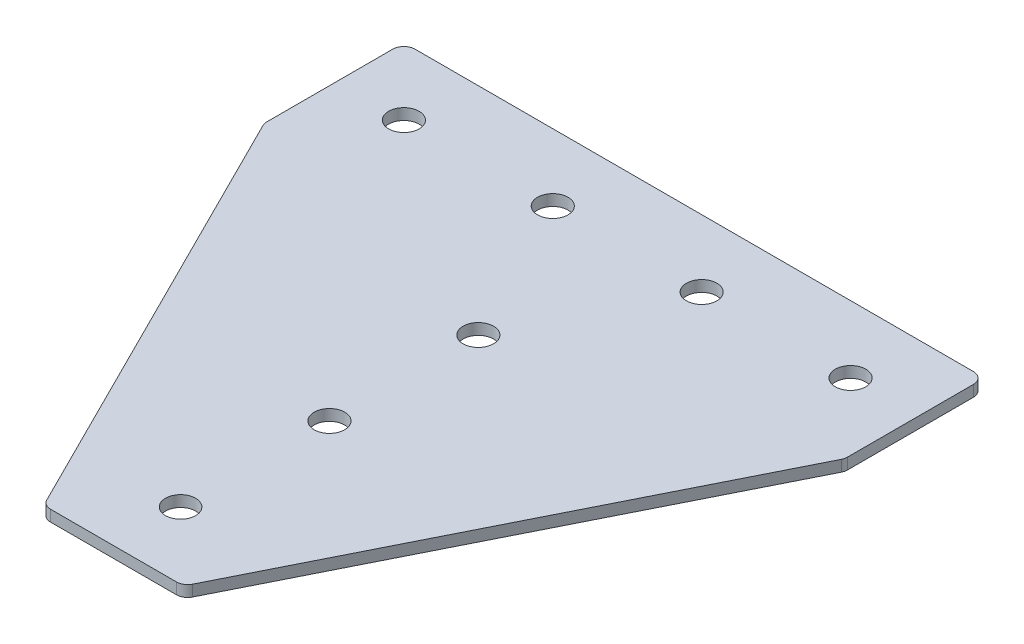
ISO-10303-21;
HEADER;
FILE_DESCRIPTION(('STEP AP214'),'2;1');
FILE_NAME('part.step','',(''),(''),'','','');
FILE_SCHEMA(('AUTOMOTIVE_DESIGN { 1 0 10303 214 1 1 1 1 }'));
ENDSEC;
DATA;
#1=APPLICATION_CONTEXT('core data for automotive mechanical design processes');
#2=APPLICATION_PROTOCOL_DEFINITION('international standard','automotive_design',2000,#1);
#3=PRODUCT_CONTEXT('',#1,'mechanical');
#4=PRODUCT('Part','Part','',(#3));
#5=PRODUCT_RELATED_PRODUCT_CATEGORY('part','',(#4));
#6=PRODUCT_DEFINITION_FORMATION('','',#4);
#7=PRODUCT_DEFINITION_CONTEXT('part definition',#1,'design');
#8=PRODUCT_DEFINITION('design','',#6,#7);
#9=PRODUCT_DEFINITION_SHAPE('','',#8);
#10=(LENGTH_UNIT() NAMED_UNIT(*) SI_UNIT(.MILLI.,.METRE.));
#11=(NAMED_UNIT(*) PLANE_ANGLE_UNIT() SI_UNIT($,.RADIAN.));
#12=(NAMED_UNIT(*) SI_UNIT($,.STERADIAN.) SOLID_ANGLE_UNIT());
#13=UNCERTAINTY_MEASURE_WITH_UNIT(LENGTH_MEASURE(1.E-05),#10,'distance_accuracy_value','');
#14=(GEOMETRIC_REPRESENTATION_CONTEXT(3) GLOBAL_UNCERTAINTY_ASSIGNED_CONTEXT((#13)) GLOBAL_UNIT_ASSIGNED_CONTEXT((#10,
#11,#12)) REPRESENTATION_CONTEXT('',''));
#15=CARTESIAN_POINT('',(0.,0.,0.));
#16=DIRECTION('',(0.,0.,1.));
#17=DIRECTION('',(1.,0.,0.));
#18=AXIS2_PLACEMENT_3D('',#15,#16,#17);
#19=CARTESIAN_POINT('',(-1.64111741986517,1.20798729371791,-61.0664297859648));
#20=DIRECTION('',(0.,-1.,0.));
#21=DIRECTION('',(0.,0.,-1.));
#22=AXIS2_PLACEMENT_3D('',#19,#20,#21);
#23=PLANE('',#22);
#24=CARTESIAN_POINT('',(-1.64111741986518,1.20798729371791,-21.0664297859648));
#25=DIRECTION('',(0.,1.,0.));
#26=DIRECTION('',(0.,0.,1.));
#27=AXIS2_PLACEMENT_3D('',#24,#25,#26);
#28=CIRCLE('',#27,4.1);
#29=CARTESIAN_POINT('',(-1.64111741986518,1.20798729371791,-16.9664297859648));
#30=VERTEX_POINT('',#29);
#31=EDGE_CURVE('E183',#30,#30,#28,.T.);
#32=ORIENTED_EDGE('',*,*,#31,.T.);
#33=EDGE_LOOP('',(#32));
#34=FACE_BOUND('',#33,.T.);
#35=DIRECTION('',(1.,0.,0.));
#36=VECTOR('',#35,1.);
#37=CARTESIAN_POINT('',(-19.6411174198652,1.20798729371791,76.9335702140352));
#38=LINE('',#37,#36);
#39=CARTESIAN_POINT('',(-18.5509474761156,1.20798729371791,76.9335702140352));
#40=VERTEX_POINT('',#39);
#41=CARTESIAN_POINT('',(15.2687126363853,1.20798729371791,76.9335702140352));
#42=VERTEX_POINT('',#41);
#43=EDGE_CURVE('E201',#40,#42,#38,.T.);
#44=ORIENTED_EDGE('',*,*,#43,.F.);
#45=CARTESIAN_POINT('',(-18.5509474761156,1.20798729371791,73.9335702140352));
#46=DIRECTION('',(0.,1.,0.));
#47=DIRECTION('',(0.,0.,-1.));
#48=AXIS2_PLACEMENT_3D('',#45,#46,#47);
#49=CIRCLE('',#48,3.);
#50=CARTESIAN_POINT('',(-21.2342290491154,1.20798729371791,75.275211000535));
#51=VERTEX_POINT('',#50);
#52=EDGE_CURVE('E155',#51,#40,#49,.T.);
#53=ORIENTED_EDGE('',*,*,#52,.F.);
#54=DIRECTION('',(-0.447213595499958,0.,-0.894427190999916));
#55=VECTOR('',#54,1.);
#56=CARTESIAN_POINT('',(-20.4050494423653,1.20798729371791,76.9335702140352));
#57=LINE('',#56,#55);
#58=CARTESIAN_POINT('',(-79.3243989928649,1.20798729371791,-40.9051288869639));
#59=VERTEX_POINT('',#58);
#60=EDGE_CURVE('E142',#51,#59,#57,.T.);
#61=ORIENTED_EDGE('',*,*,#60,.T.);
#62=CARTESIAN_POINT('',(-76.6411174198652,1.20798729371791,-42.2467696734637));
#63=DIRECTION('',(0.,1.,0.));
#64=DIRECTION('',(0.,0.,-1.));
#65=AXIS2_PLACEMENT_3D('',#62,#63,#64);
#66=CIRCLE('',#65,3.);
#67=CARTESIAN_POINT('',(-79.6411174198652,1.20798729371791,-42.2467696734637));
#68=VERTEX_POINT('',#67);
#69=EDGE_CURVE('E153',#68,#59,#66,.T.);
#70=ORIENTED_EDGE('',*,*,#69,.F.);
#71=DIRECTION('',(0.,0.,-1.));
#72=VECTOR('',#71,1.);
#73=CARTESIAN_POINT('',(-79.6411174198652,1.20798729371791,-41.5385657409644));
#74=LINE('',#73,#72);
#75=CARTESIAN_POINT('',(-79.6411174198652,1.20798729371791,-76.0664297859648));
#76=VERTEX_POINT('',#75);
#77=EDGE_CURVE('E124',#68,#76,#74,.T.);
#78=ORIENTED_EDGE('',*,*,#77,.T.);
#79=CARTESIAN_POINT('',(-76.6411174198652,1.20798729371791,-76.0664297859648));
#80=DIRECTION('',(0.,1.,0.));
#81=DIRECTION('',(0.,0.,-1.));
#82=AXIS2_PLACEMENT_3D('',#79,#80,#81);
#83=CIRCLE('',#82,3.);
#84=CARTESIAN_POINT('',(-76.6411174198652,1.20798729371791,-79.0664297859648));
#85=VERTEX_POINT('',#84);
#86=EDGE_CURVE('E150',#85,#76,#83,.T.);
#87=ORIENTED_EDGE('',*,*,#86,.F.);
#88=DIRECTION('',(-1.,0.,0.));
#89=VECTOR('',#88,1.);
#90=CARTESIAN_POINT('',(76.3588825801348,1.20798729371791,-79.0664297859648));
#91=LINE('',#90,#89);
#92=CARTESIAN_POINT('',(73.3588825801348,1.20798729371791,-79.0664297859648));
#93=VERTEX_POINT('',#92);
#94=EDGE_CURVE('E198',#93,#85,#91,.T.);
#95=ORIENTED_EDGE('',*,*,#94,.F.);
#96=CARTESIAN_POINT('',(73.3588825801348,1.20798729371791,-76.0664297859648));
#97=DIRECTION('',(0.,-1.,0.));
#98=DIRECTION('',(0.,0.,-1.));
#99=AXIS2_PLACEMENT_3D('',#96,#97,#98);
#100=CIRCLE('',#99,3.);
#101=CARTESIAN_POINT('',(76.3588825801348,1.20798729371791,-76.0664297859648));
#102=VERTEX_POINT('',#101);
#103=EDGE_CURVE('E222',#93,#102,#100,.T.);
#104=ORIENTED_EDGE('',*,*,#103,.T.);
#105=DIRECTION('',(0.,0.,-1.));
#106=VECTOR('',#105,1.);
#107=CARTESIAN_POINT('',(76.3588825801348,1.20798729371791,-41.5385657409644));
#108=LINE('',#107,#106);
#109=CARTESIAN_POINT('',(76.3588825801348,1.20798729371791,-42.2467696734638));
#110=VERTEX_POINT('',#109);
#111=EDGE_CURVE('E195',#110,#102,#108,.T.);
#112=ORIENTED_EDGE('',*,*,#111,.F.);
#113=CARTESIAN_POINT('',(73.3588825801349,1.20798729371791,-42.2467696734638));
#114=DIRECTION('',(0.,-1.,0.));
#115=DIRECTION('',(0.,0.,-1.));
#116=AXIS2_PLACEMENT_3D('',#113,#114,#115);
#117=CIRCLE('',#116,3.);
#118=CARTESIAN_POINT('',(76.0421641531346,1.20798729371791,-40.9051288869639));
#119=VERTEX_POINT('',#118);
#120=EDGE_CURVE('E31',#110,#119,#117,.T.);
#121=ORIENTED_EDGE('',*,*,#120,.T.);
#122=DIRECTION('',(0.447213595499958,0.,-0.894427190999916));
#123=VECTOR('',#122,1.);
#124=CARTESIAN_POINT('',(17.122814602635,1.20798729371791,76.9335702140352));
#125=LINE('',#124,#123);
#126=CARTESIAN_POINT('',(17.9519942093851,1.20798729371791,75.275211000535));
#127=VERTEX_POINT('',#126);
#128=EDGE_CURVE('E203',#127,#119,#125,.T.);
#129=ORIENTED_EDGE('',*,*,#128,.F.);
#130=CARTESIAN_POINT('',(15.2687126363853,1.20798729371791,73.9335702140352));
#131=DIRECTION('',(0.,-1.,0.));
#132=DIRECTION('',(0.,0.,-1.));
#133=AXIS2_PLACEMENT_3D('',#130,#131,#132);
#134=CIRCLE('',#133,3.);
#135=EDGE_CURVE('E225',#127,#42,#134,.T.);
#136=ORIENTED_EDGE('',*,*,#135,.T.);
#137=EDGE_LOOP('',(#44,#53,#61,#70,#78,#87,#95,#104,#112,#121,#129,#136));
#138=FACE_BOUND('',#137,.T.);
#139=CARTESIAN_POINT('',(-1.64111741986518,1.20798729371791,58.9335702140352));
#140=DIRECTION('',(0.,1.,0.));
#141=DIRECTION('',(0.,0.,1.));
#142=AXIS2_PLACEMENT_3D('',#139,#140,#141);
#143=CIRCLE('',#142,4.05);
#144=CARTESIAN_POINT('',(-1.64111741986518,1.20798729371791,62.9835702140352));
#145=VERTEX_POINT('',#144);
#146=EDGE_CURVE('E171',#145,#145,#143,.T.);
#147=ORIENTED_EDGE('',*,*,#146,.T.);
#148=EDGE_LOOP('',(#147));
#149=FACE_BOUND('',#148,.T.);
#150=CARTESIAN_POINT('',(-1.64111741986518,1.20798729371791,18.9335702140352));
#151=DIRECTION('',(0.,1.,0.));
#152=DIRECTION('',(0.,0.,1.));
#153=AXIS2_PLACEMENT_3D('',#150,#151,#152);
#154=CIRCLE('',#153,4.1);
#155=CARTESIAN_POINT('',(-1.64111741986518,1.20798729371791,23.0335702140352));
#156=VERTEX_POINT('',#155);
#157=EDGE_CURVE('E177',#156,#156,#154,.T.);
#158=ORIENTED_EDGE('',*,*,#157,.T.);
#159=EDGE_LOOP('',(#158));
#160=FACE_BOUND('',#159,.T.);
#161=CARTESIAN_POINT('',(58.3588825801348,1.20798729371791,-61.0664297859648));
#162=DIRECTION('',(0.,1.,0.));
#163=DIRECTION('',(0.,0.,1.));
#164=AXIS2_PLACEMENT_3D('',#161,#162,#163);
#165=CIRCLE('',#164,4.09999999999999);
#166=CARTESIAN_POINT('',(58.3588825801348,1.20798729371791,-56.9664297859648));
#167=VERTEX_POINT('',#166);
#168=EDGE_CURVE('E165',#167,#167,#165,.T.);
#169=ORIENTED_EDGE('',*,*,#168,.T.);
#170=EDGE_LOOP('',(#169));
#171=FACE_BOUND('',#170,.T.);
#172=CARTESIAN_POINT('',(18.3588825801348,1.20798729371791,-61.0664297859648));
#173=DIRECTION('',(0.,1.,0.));
#174=DIRECTION('',(0.,0.,1.));
#175=AXIS2_PLACEMENT_3D('',#172,#173,#174);
#176=CIRCLE('',#175,4.1);
#177=CARTESIAN_POINT('',(18.3588825801348,1.20798729371791,-56.9664297859648));
#178=VERTEX_POINT('',#177);
#179=EDGE_CURVE('E189',#178,#178,#176,.T.);
#180=ORIENTED_EDGE('',*,*,#179,.T.);
#181=EDGE_LOOP('',(#180));
#182=FACE_BOUND('',#181,.T.);
#183=CARTESIAN_POINT('',(-61.6411174198652,1.20798729371791,-61.0664297859648));
#184=DIRECTION('',(0.,-1.,0.));
#185=DIRECTION('',(0.,0.,1.));
#186=AXIS2_PLACEMENT_3D('',#183,#184,#185);
#187=CIRCLE('',#186,4.09999999999999);
#188=CARTESIAN_POINT('',(-61.6411174198652,1.20798729371791,-56.9664297859648));
#189=VERTEX_POINT('',#188);
#190=EDGE_CURVE('E265',#189,#189,#187,.T.);
#191=ORIENTED_EDGE('',*,*,#190,.F.);
#192=EDGE_LOOP('',(#191));
#193=FACE_BOUND('',#192,.T.);
#194=CARTESIAN_POINT('',(-21.6411174198652,1.20798729371791,-61.0664297859648));
#195=DIRECTION('',(0.,-1.,0.));
#196=DIRECTION('',(0.,0.,1.));
#197=AXIS2_PLACEMENT_3D('',#194,#195,#196);
#198=CIRCLE('',#197,4.1);
#199=CARTESIAN_POINT('',(-21.6411174198652,1.20798729371791,-56.9664297859648));
#200=VERTEX_POINT('',#199);
#201=EDGE_CURVE('E135',#200,#200,#198,.T.);
#202=ORIENTED_EDGE('',*,*,#201,.F.);
#203=EDGE_LOOP('',(#202));
#204=FACE_BOUND('',#203,.T.);
#205=ADVANCED_FACE('F16',(#34,#138,#149,#160,#171,#182,#193,#204),#23,.T.);
#206=CARTESIAN_POINT('',(76.3588825801348,1.20798729371791,-41.5385657409644));
#207=DIRECTION('',(1.,0.,0.));
#208=DIRECTION('',(0.,0.,-1.));
#209=AXIS2_PLACEMENT_3D('',#206,#207,#208);
#210=PLANE('',#209);
#211=DIRECTION('',(0.,0.,-1.));
#212=VECTOR('',#211,1.);
#213=CARTESIAN_POINT('',(76.3588825801348,4.20798729371791,-41.5385657409644));
#214=LINE('',#213,#212);
#215=CARTESIAN_POINT('',(76.3588825801348,4.20798729371791,-42.2467696734638));
#216=VERTEX_POINT('',#215);
#217=CARTESIAN_POINT('',(76.3588825801348,4.20798729371791,-76.0664297859648));
#218=VERTEX_POINT('',#217);
#219=EDGE_CURVE('E192',#216,#218,#214,.T.);
#220=ORIENTED_EDGE('',*,*,#219,.F.);
#221=DIRECTION('',(0.,1.,0.));
#222=VECTOR('',#221,1.);
#223=CARTESIAN_POINT('',(76.3588825801348,1.20798729371791,-42.2467696734638));
#224=LINE('',#223,#222);
#225=EDGE_CURVE('E24',#216,#110,#224,.F.);
#226=ORIENTED_EDGE('',*,*,#225,.T.);
#227=ORIENTED_EDGE('',*,*,#111,.T.);
#228=DIRECTION('',(0.,1.,0.));
#229=VECTOR('',#228,1.);
#230=CARTESIAN_POINT('',(76.3588825801348,1.20798729371791,-76.0664297859648));
#231=LINE('',#230,#229);
#232=EDGE_CURVE('E232',#102,#218,#231,.T.);
#233=ORIENTED_EDGE('',*,*,#232,.T.);
#234=EDGE_LOOP('',(#220,#226,#227,#233));
#235=FACE_BOUND('',#234,.T.);
#236=ADVANCED_FACE('F237',(#235),#210,.T.);
#237=CARTESIAN_POINT('',(17.122814602635,1.20798729371791,76.9335702140352));
#238=DIRECTION('',(0.894427190999916,0.,0.447213595499958));
#239=DIRECTION('',(0.447213595499958,0.,-0.894427190999916));
#240=AXIS2_PLACEMENT_3D('',#237,#238,#239);
#241=PLANE('',#240);
#242=DIRECTION('',(0.447213595499958,0.,-0.894427190999916));
#243=VECTOR('',#242,1.);
#244=CARTESIAN_POINT('',(17.122814602635,4.20798729371791,76.9335702140352));
#245=LINE('',#244,#243);
#246=CARTESIAN_POINT('',(17.9519942093851,4.20798729371791,75.275211000535));
#247=VERTEX_POINT('',#246);
#248=CARTESIAN_POINT('',(76.0421641531346,4.20798729371791,-40.9051288869639));
#249=VERTEX_POINT('',#248);
#250=EDGE_CURVE('E199',#247,#249,#245,.T.);
#251=ORIENTED_EDGE('',*,*,#250,.F.);
#252=DIRECTION('',(0.,1.,0.));
#253=VECTOR('',#252,1.);
#254=CARTESIAN_POINT('',(17.9519942093851,1.20798729371791,75.275211000535));
#255=LINE('',#254,#253);
#256=EDGE_CURVE('E38',#247,#127,#255,.F.);
#257=ORIENTED_EDGE('',*,*,#256,.T.);
#258=ORIENTED_EDGE('',*,*,#128,.T.);
#259=DIRECTION('',(0.,1.,0.));
#260=VECTOR('',#259,1.);
#261=CARTESIAN_POINT('',(76.0421641531346,1.20798729371791,-40.9051288869639));
#262=LINE('',#261,#260);
#263=EDGE_CURVE('E228',#119,#249,#262,.T.);
#264=ORIENTED_EDGE('',*,*,#263,.T.);
#265=EDGE_LOOP('',(#251,#257,#258,#264));
#266=FACE_BOUND('',#265,.T.);
#267=ADVANCED_FACE('F245',(#266),#241,.T.);
#268=CARTESIAN_POINT('',(-19.6411174198652,1.20798729371791,76.9335702140352));
#269=DIRECTION('',(0.,0.,1.));
#270=DIRECTION('',(1.,0.,0.));
#271=AXIS2_PLACEMENT_3D('',#268,#269,#270);
#272=PLANE('',#271);
#273=DIRECTION('',(1.,0.,0.));
#274=VECTOR('',#273,1.);
#275=CARTESIAN_POINT('',(-19.6411174198652,4.20798729371791,76.9335702140352));
#276=LINE('',#275,#274);
#277=CARTESIAN_POINT('',(-18.5509474761156,4.20798729371791,76.9335702140352));
#278=VERTEX_POINT('',#277);
#279=CARTESIAN_POINT('',(15.2687126363853,4.20798729371791,76.9335702140352));
#280=VERTEX_POINT('',#279);
#281=EDGE_CURVE('E210',#278,#280,#276,.T.);
#282=ORIENTED_EDGE('',*,*,#281,.F.);
#283=DIRECTION('',(0.,1.,0.));
#284=VECTOR('',#283,1.);
#285=CARTESIAN_POINT('',(-18.5509474761156,1.20798729371791,76.9335702140352));
#286=LINE('',#285,#284);
#287=EDGE_CURVE('E147',#40,#278,#286,.T.);
#288=ORIENTED_EDGE('',*,*,#287,.F.);
#289=ORIENTED_EDGE('',*,*,#43,.T.);
#290=DIRECTION('',(0.,1.,0.));
#291=VECTOR('',#290,1.);
#292=CARTESIAN_POINT('',(15.2687126363853,1.20798729371791,76.9335702140352));
#293=LINE('',#292,#291);
#294=EDGE_CURVE('E219',#42,#280,#293,.T.);
#295=ORIENTED_EDGE('',*,*,#294,.T.);
#296=EDGE_LOOP('',(#282,#288,#289,#295));
#297=FACE_BOUND('',#296,.T.);
#298=ADVANCED_FACE('F252',(#297),#272,.T.);
#299=CARTESIAN_POINT('',(76.3588825801348,1.20798729371791,-79.0664297859648));
#300=DIRECTION('',(0.,0.,-1.));
#301=DIRECTION('',(-1.,0.,0.));
#302=AXIS2_PLACEMENT_3D('',#299,#300,#301);
#303=PLANE('',#302);
#304=ORIENTED_EDGE('',*,*,#94,.T.);
#305=DIRECTION('',(0.,1.,0.));
#306=VECTOR('',#305,1.);
#307=CARTESIAN_POINT('',(-76.6411174198652,1.20798729371791,-79.0664297859648));
#308=LINE('',#307,#306);
#309=CARTESIAN_POINT('',(-76.6411174198652,4.20798729371791,-79.0664297859648));
#310=VERTEX_POINT('',#309);
#311=EDGE_CURVE('E126',#310,#85,#308,.F.);
#312=ORIENTED_EDGE('',*,*,#311,.F.);
#313=DIRECTION('',(-1.,0.,0.));
#314=VECTOR('',#313,1.);
#315=CARTESIAN_POINT('',(76.3588825801348,4.20798729371791,-79.0664297859648));
#316=LINE('',#315,#314);
#317=CARTESIAN_POINT('',(73.3588825801348,4.20798729371791,-79.0664297859648));
#318=VERTEX_POINT('',#317);
#319=EDGE_CURVE('E208',#318,#310,#316,.T.);
#320=ORIENTED_EDGE('',*,*,#319,.F.);
#321=DIRECTION('',(0.,1.,0.));
#322=VECTOR('',#321,1.);
#323=CARTESIAN_POINT('',(73.3588825801348,1.20798729371791,-79.0664297859648));
#324=LINE('',#323,#322);
#325=EDGE_CURVE('E10',#318,#93,#324,.F.);
#326=ORIENTED_EDGE('',*,*,#325,.T.);
#327=EDGE_LOOP('',(#304,#312,#320,#326));
#328=FACE_BOUND('',#327,.T.);
#329=ADVANCED_FACE('F290',(#328),#303,.T.);
#330=CARTESIAN_POINT('',(-1.64111741986517,4.20798729371791,-61.0664297859648));
#331=DIRECTION('',(0.,-1.,0.));
#332=DIRECTION('',(0.,0.,-1.));
#333=AXIS2_PLACEMENT_3D('',#330,#331,#332);
#334=PLANE('',#333);
#335=CARTESIAN_POINT('',(-1.64111741986518,4.20798729371791,-21.0664297859648));
#336=DIRECTION('',(0.,1.,0.));
#337=DIRECTION('',(0.,0.,1.));
#338=AXIS2_PLACEMENT_3D('',#335,#336,#337);
#339=CIRCLE('',#338,4.1);
#340=CARTESIAN_POINT('',(-1.64111741986518,4.20798729371791,-16.9664297859648));
#341=VERTEX_POINT('',#340);
#342=EDGE_CURVE('E180',#341,#341,#339,.T.);
#343=ORIENTED_EDGE('',*,*,#342,.F.);
#344=EDGE_LOOP('',(#343));
#345=FACE_BOUND('',#344,.T.);
#346=CARTESIAN_POINT('',(-18.5509474761156,4.20798729371791,73.9335702140352));
#347=DIRECTION('',(0.,1.,0.));
#348=DIRECTION('',(0.,0.,-1.));
#349=AXIS2_PLACEMENT_3D('',#346,#347,#348);
#350=CIRCLE('',#349,3.);
#351=CARTESIAN_POINT('',(-21.2342290491154,4.20798729371791,75.275211000535));
#352=VERTEX_POINT('',#351);
#353=EDGE_CURVE('E116',#278,#352,#350,.F.);
#354=ORIENTED_EDGE('',*,*,#353,.F.);
#355=ORIENTED_EDGE('',*,*,#281,.T.);
#356=CARTESIAN_POINT('',(15.2687126363853,4.20798729371791,73.9335702140352));
#357=DIRECTION('',(0.,-1.,0.));
#358=DIRECTION('',(0.,0.,-1.));
#359=AXIS2_PLACEMENT_3D('',#356,#357,#358);
#360=CIRCLE('',#359,3.);
#361=EDGE_CURVE('E217',#280,#247,#360,.F.);
#362=ORIENTED_EDGE('',*,*,#361,.T.);
#363=ORIENTED_EDGE('',*,*,#250,.T.);
#364=CARTESIAN_POINT('',(73.3588825801349,4.20798729371791,-42.2467696734638));
#365=DIRECTION('',(0.,-1.,0.));
#366=DIRECTION('',(0.,0.,-1.));
#367=AXIS2_PLACEMENT_3D('',#364,#365,#366);
#368=CIRCLE('',#367,3.);
#369=EDGE_CURVE('E215',#249,#216,#368,.F.);
#370=ORIENTED_EDGE('',*,*,#369,.T.);
#371=ORIENTED_EDGE('',*,*,#219,.T.);
#372=CARTESIAN_POINT('',(73.3588825801348,4.20798729371791,-76.0664297859648));
#373=DIRECTION('',(0.,-1.,0.));
#374=DIRECTION('',(0.,0.,-1.));
#375=AXIS2_PLACEMENT_3D('',#372,#373,#374);
#376=CIRCLE('',#375,3.);
#377=EDGE_CURVE('E205',#218,#318,#376,.F.);
#378=ORIENTED_EDGE('',*,*,#377,.T.);
#379=ORIENTED_EDGE('',*,*,#319,.T.);
#380=CARTESIAN_POINT('',(-76.6411174198652,4.20798729371791,-76.0664297859648));
#381=DIRECTION('',(0.,1.,0.));
#382=DIRECTION('',(0.,0.,-1.));
#383=AXIS2_PLACEMENT_3D('',#380,#381,#382);
#384=CIRCLE('',#383,3.);
#385=CARTESIAN_POINT('',(-79.6411174198652,4.20798729371791,-76.0664297859648));
#386=VERTEX_POINT('',#385);
#387=EDGE_CURVE('E117',#386,#310,#384,.F.);
#388=ORIENTED_EDGE('',*,*,#387,.F.);
#389=DIRECTION('',(0.,0.,-1.));
#390=VECTOR('',#389,1.);
#391=CARTESIAN_POINT('',(-79.6411174198652,4.20798729371791,-41.5385657409644));
#392=LINE('',#391,#390);
#393=CARTESIAN_POINT('',(-79.6411174198652,4.20798729371791,-42.2467696734637));
#394=VERTEX_POINT('',#393);
#395=EDGE_CURVE('E122',#394,#386,#392,.T.);
#396=ORIENTED_EDGE('',*,*,#395,.F.);
#397=CARTESIAN_POINT('',(-76.6411174198652,4.20798729371791,-42.2467696734637));
#398=DIRECTION('',(0.,1.,0.));
#399=DIRECTION('',(0.,0.,-1.));
#400=AXIS2_PLACEMENT_3D('',#397,#398,#399);
#401=CIRCLE('',#400,3.);
#402=CARTESIAN_POINT('',(-79.3243989928649,4.20798729371791,-40.9051288869639));
#403=VERTEX_POINT('',#402);
#404=EDGE_CURVE('E105',#403,#394,#401,.F.);
#405=ORIENTED_EDGE('',*,*,#404,.F.);
#406=DIRECTION('',(-0.447213595499958,0.,-0.894427190999916));
#407=VECTOR('',#406,1.);
#408=CARTESIAN_POINT('',(-20.4050494423653,4.20798729371791,76.9335702140352));
#409=LINE('',#408,#407);
#410=EDGE_CURVE('E134',#352,#403,#409,.T.);
#411=ORIENTED_EDGE('',*,*,#410,.F.);
#412=EDGE_LOOP('',(#354,#355,#362,#363,#370,#371,#378,#379,#388,#396,#405,#411));
#413=FACE_BOUND('',#412,.T.);
#414=CARTESIAN_POINT('',(-1.64111741986518,4.20798729371791,58.9335702140352));
#415=DIRECTION('',(0.,1.,0.));
#416=DIRECTION('',(0.,0.,1.));
#417=AXIS2_PLACEMENT_3D('',#414,#415,#416);
#418=CIRCLE('',#417,4.05);
#419=CARTESIAN_POINT('',(-1.64111741986518,4.20798729371791,62.9835702140352));
#420=VERTEX_POINT('',#419);
#421=EDGE_CURVE('E168',#420,#420,#418,.T.);
#422=ORIENTED_EDGE('',*,*,#421,.F.);
#423=EDGE_LOOP('',(#422));
#424=FACE_BOUND('',#423,.T.);
#425=CARTESIAN_POINT('',(58.3588825801348,4.20798729371791,-61.0664297859648));
#426=DIRECTION('',(0.,1.,0.));
#427=DIRECTION('',(0.,0.,1.));
#428=AXIS2_PLACEMENT_3D('',#425,#426,#427);
#429=CIRCLE('',#428,4.09999999999999);
#430=CARTESIAN_POINT('',(58.3588825801348,4.20798729371791,-56.9664297859648));
#431=VERTEX_POINT('',#430);
#432=EDGE_CURVE('E164',#431,#431,#429,.T.);
#433=ORIENTED_EDGE('',*,*,#432,.F.);
#434=EDGE_LOOP('',(#433));
#435=FACE_BOUND('',#434,.T.);
#436=CARTESIAN_POINT('',(-1.64111741986518,4.20798729371791,18.9335702140352));
#437=DIRECTION('',(0.,1.,0.));
#438=DIRECTION('',(0.,0.,1.));
#439=AXIS2_PLACEMENT_3D('',#436,#437,#438);
#440=CIRCLE('',#439,4.1);
#441=CARTESIAN_POINT('',(-1.64111741986518,4.20798729371791,23.0335702140352));
#442=VERTEX_POINT('',#441);
#443=EDGE_CURVE('E174',#442,#442,#440,.T.);
#444=ORIENTED_EDGE('',*,*,#443,.F.);
#445=EDGE_LOOP('',(#444));
#446=FACE_BOUND('',#445,.T.);
#447=CARTESIAN_POINT('',(18.3588825801348,4.20798729371791,-61.0664297859648));
#448=DIRECTION('',(0.,1.,0.));
#449=DIRECTION('',(0.,0.,1.));
#450=AXIS2_PLACEMENT_3D('',#447,#448,#449);
#451=CIRCLE('',#450,4.1);
#452=CARTESIAN_POINT('',(18.3588825801348,4.20798729371791,-56.9664297859648));
#453=VERTEX_POINT('',#452);
#454=EDGE_CURVE('E186',#453,#453,#451,.T.);
#455=ORIENTED_EDGE('',*,*,#454,.F.);
#456=EDGE_LOOP('',(#455));
#457=FACE_BOUND('',#456,.T.);
#458=CARTESIAN_POINT('',(-61.6411174198652,4.20798729371791,-61.0664297859648));
#459=DIRECTION('',(0.,-1.,0.));
#460=DIRECTION('',(0.,0.,1.));
#461=AXIS2_PLACEMENT_3D('',#458,#459,#460);
#462=CIRCLE('',#461,4.09999999999999);
#463=CARTESIAN_POINT('',(-61.6411174198652,4.20798729371791,-56.9664297859648));
#464=VERTEX_POINT('',#463);
#465=EDGE_CURVE('E267',#464,#464,#462,.T.);
#466=ORIENTED_EDGE('',*,*,#465,.T.);
#467=EDGE_LOOP('',(#466));
#468=FACE_BOUND('',#467,.T.);
#469=CARTESIAN_POINT('',(-21.6411174198652,4.20798729371791,-61.0664297859648));
#470=DIRECTION('',(0.,-1.,0.));
#471=DIRECTION('',(0.,0.,1.));
#472=AXIS2_PLACEMENT_3D('',#469,#470,#471);
#473=CIRCLE('',#472,4.1);
#474=CARTESIAN_POINT('',(-21.6411174198652,4.20798729371791,-56.9664297859648));
#475=VERTEX_POINT('',#474);
#476=EDGE_CURVE('E139',#475,#475,#473,.T.);
#477=ORIENTED_EDGE('',*,*,#476,.T.);
#478=EDGE_LOOP('',(#477));
#479=FACE_BOUND('',#478,.T.);
#480=ADVANCED_FACE('F130',(#345,#413,#424,#435,#446,#457,#468,#479),#334,.F.);
#481=CARTESIAN_POINT('',(15.2687126363853,1.20798729371791,73.9335702140352));
#482=DIRECTION('',(0.,1.,0.));
#483=DIRECTION('',(0.,0.,1.));
#484=AXIS2_PLACEMENT_3D('',#481,#482,#483);
#485=CYLINDRICAL_SURFACE('',#484,3.);
#486=ORIENTED_EDGE('',*,*,#135,.F.);
#487=ORIENTED_EDGE('',*,*,#256,.F.);
#488=ORIENTED_EDGE('',*,*,#361,.F.);
#489=ORIENTED_EDGE('',*,*,#294,.F.);
#490=EDGE_LOOP('',(#486,#487,#488,#489));
#491=FACE_BOUND('',#490,.T.);
#492=ADVANCED_FACE('F250',(#491),#485,.T.);
#493=CARTESIAN_POINT('',(73.3588825801349,1.20798729371791,-42.2467696734638));
#494=DIRECTION('',(0.,1.,0.));
#495=DIRECTION('',(0.,0.,1.));
#496=AXIS2_PLACEMENT_3D('',#493,#494,#495);
#497=CYLINDRICAL_SURFACE('',#496,3.);
#498=ORIENTED_EDGE('',*,*,#120,.F.);
#499=ORIENTED_EDGE('',*,*,#225,.F.);
#500=ORIENTED_EDGE('',*,*,#369,.F.);
#501=ORIENTED_EDGE('',*,*,#263,.F.);
#502=EDGE_LOOP('',(#498,#499,#500,#501));
#503=FACE_BOUND('',#502,.T.);
#504=ADVANCED_FACE('F244',(#503),#497,.T.);
#505=CARTESIAN_POINT('',(73.3588825801348,1.20798729371791,-76.0664297859648));
#506=DIRECTION('',(0.,1.,0.));
#507=DIRECTION('',(0.,0.,1.));
#508=AXIS2_PLACEMENT_3D('',#505,#506,#507);
#509=CYLINDRICAL_SURFACE('',#508,3.);
#510=ORIENTED_EDGE('',*,*,#103,.F.);
#511=ORIENTED_EDGE('',*,*,#325,.F.);
#512=ORIENTED_EDGE('',*,*,#377,.F.);
#513=ORIENTED_EDGE('',*,*,#232,.F.);
#514=EDGE_LOOP('',(#510,#511,#512,#513));
#515=FACE_BOUND('',#514,.T.);
#516=ADVANCED_FACE('F18',(#515),#509,.T.);
#517=CARTESIAN_POINT('',(18.3588825801348,1.20798729371791,-61.0664297859648));
#518=DIRECTION('',(0.,1.,0.));
#519=DIRECTION('',(0.,0.,1.));
#520=AXIS2_PLACEMENT_3D('',#517,#518,#519);
#521=CYLINDRICAL_SURFACE('',#520,4.1);
#522=ORIENTED_EDGE('',*,*,#179,.F.);
#523=EDGE_LOOP('',(#522));
#524=FACE_BOUND('',#523,.T.);
#525=ORIENTED_EDGE('',*,*,#454,.T.);
#526=EDGE_LOOP('',(#525));
#527=FACE_BOUND('',#526,.T.);
#528=ADVANCED_FACE('F307',(#524,#527),#521,.F.);
#529=CARTESIAN_POINT('',(-1.64111741986518,1.20798729371791,-21.0664297859648));
#530=DIRECTION('',(0.,1.,0.));
#531=DIRECTION('',(0.,0.,1.));
#532=AXIS2_PLACEMENT_3D('',#529,#530,#531);
#533=CYLINDRICAL_SURFACE('',#532,4.1);
#534=ORIENTED_EDGE('',*,*,#31,.F.);
#535=EDGE_LOOP('',(#534));
#536=FACE_BOUND('',#535,.T.);
#537=ORIENTED_EDGE('',*,*,#342,.T.);
#538=EDGE_LOOP('',(#537));
#539=FACE_BOUND('',#538,.T.);
#540=ADVANCED_FACE('F312',(#536,#539),#533,.F.);
#541=CARTESIAN_POINT('',(-1.64111741986518,1.20798729371791,18.9335702140352));
#542=DIRECTION('',(0.,1.,0.));
#543=DIRECTION('',(0.,0.,1.));
#544=AXIS2_PLACEMENT_3D('',#541,#542,#543);
#545=CYLINDRICAL_SURFACE('',#544,4.1);
#546=ORIENTED_EDGE('',*,*,#443,.T.);
#547=EDGE_LOOP('',(#546));
#548=FACE_BOUND('',#547,.T.);
#549=ORIENTED_EDGE('',*,*,#157,.F.);
#550=EDGE_LOOP('',(#549));
#551=FACE_BOUND('',#550,.T.);
#552=ADVANCED_FACE('F334',(#548,#551),#545,.F.);
#553=CARTESIAN_POINT('',(-1.64111741986518,1.20798729371791,58.9335702140352));
#554=DIRECTION('',(0.,1.,0.));
#555=DIRECTION('',(0.,0.,1.));
#556=AXIS2_PLACEMENT_3D('',#553,#554,#555);
#557=CYLINDRICAL_SURFACE('',#556,4.05);
#558=ORIENTED_EDGE('',*,*,#421,.T.);
#559=EDGE_LOOP('',(#558));
#560=FACE_BOUND('',#559,.T.);
#561=ORIENTED_EDGE('',*,*,#146,.F.);
#562=EDGE_LOOP('',(#561));
#563=FACE_BOUND('',#562,.T.);
#564=ADVANCED_FACE('F330',(#560,#563),#557,.F.);
#565=CARTESIAN_POINT('',(58.3588825801348,1.20798729371791,-61.0664297859648));
#566=DIRECTION('',(0.,1.,0.));
#567=DIRECTION('',(0.,0.,1.));
#568=AXIS2_PLACEMENT_3D('',#565,#566,#567);
#569=CYLINDRICAL_SURFACE('',#568,4.09999999999999);
#570=ORIENTED_EDGE('',*,*,#168,.F.);
#571=EDGE_LOOP('',(#570));
#572=FACE_BOUND('',#571,.T.);
#573=ORIENTED_EDGE('',*,*,#432,.T.);
#574=EDGE_LOOP('',(#573));
#575=FACE_BOUND('',#574,.T.);
#576=ADVANCED_FACE('F327',(#572,#575),#569,.F.);
#577=CARTESIAN_POINT('',(-79.6411174198652,1.20798729371791,-41.5385657409644));
#578=DIRECTION('',(-1.,0.,0.));
#579=DIRECTION('',(0.,0.,-1.));
#580=AXIS2_PLACEMENT_3D('',#577,#578,#579);
#581=PLANE('',#580);
#582=ORIENTED_EDGE('',*,*,#395,.T.);
#583=DIRECTION('',(0.,1.,0.));
#584=VECTOR('',#583,1.);
#585=CARTESIAN_POINT('',(-79.6411174198652,1.20798729371791,-76.0664297859648));
#586=LINE('',#585,#584);
#587=EDGE_CURVE('E127',#76,#386,#586,.T.);
#588=ORIENTED_EDGE('',*,*,#587,.F.);
#589=ORIENTED_EDGE('',*,*,#77,.F.);
#590=DIRECTION('',(0.,1.,0.));
#591=VECTOR('',#590,1.);
#592=CARTESIAN_POINT('',(-79.6411174198652,1.20798729371791,-42.2467696734637));
#593=LINE('',#592,#591);
#594=EDGE_CURVE('E109',#394,#68,#593,.F.);
#595=ORIENTED_EDGE('',*,*,#594,.F.);
#596=EDGE_LOOP('',(#582,#588,#589,#595));
#597=FACE_BOUND('',#596,.T.);
#598=ADVANCED_FACE('F121',(#597),#581,.T.);
#599=CARTESIAN_POINT('',(-20.4050494423653,1.20798729371791,76.9335702140352));
#600=DIRECTION('',(-0.894427190999916,0.,0.447213595499958));
#601=DIRECTION('',(-0.447213595499959,0.,-0.894427190999916));
#602=AXIS2_PLACEMENT_3D('',#599,#600,#601);
#603=PLANE('',#602);
#604=ORIENTED_EDGE('',*,*,#410,.T.);
#605=DIRECTION('',(0.,1.,0.));
#606=VECTOR('',#605,1.);
#607=CARTESIAN_POINT('',(-79.3243989928649,1.20798729371791,-40.9051288869639));
#608=LINE('',#607,#606);
#609=EDGE_CURVE('E111',#59,#403,#608,.T.);
#610=ORIENTED_EDGE('',*,*,#609,.F.);
#611=ORIENTED_EDGE('',*,*,#60,.F.);
#612=DIRECTION('',(0.,1.,0.));
#613=VECTOR('',#612,1.);
#614=CARTESIAN_POINT('',(-21.2342290491154,1.20798729371791,75.275211000535));
#615=LINE('',#614,#613);
#616=EDGE_CURVE('E159',#352,#51,#615,.F.);
#617=ORIENTED_EDGE('',*,*,#616,.F.);
#618=EDGE_LOOP('',(#604,#610,#611,#617));
#619=FACE_BOUND('',#618,.T.);
#620=ADVANCED_FACE('F261',(#619),#603,.T.);
#621=CARTESIAN_POINT('',(-18.5509474761156,1.20798729371791,73.9335702140352));
#622=DIRECTION('',(0.,1.,0.));
#623=DIRECTION('',(0.,0.,1.));
#624=AXIS2_PLACEMENT_3D('',#621,#622,#623);
#625=CYLINDRICAL_SURFACE('',#624,3.);
#626=ORIENTED_EDGE('',*,*,#52,.T.);
#627=ORIENTED_EDGE('',*,*,#287,.T.);
#628=ORIENTED_EDGE('',*,*,#353,.T.);
#629=ORIENTED_EDGE('',*,*,#616,.T.);
#630=EDGE_LOOP('',(#626,#627,#628,#629));
#631=FACE_BOUND('',#630,.T.);
#632=ADVANCED_FACE('F258',(#631),#625,.T.);
#633=CARTESIAN_POINT('',(-76.6411174198652,1.20798729371791,-42.2467696734637));
#634=DIRECTION('',(0.,1.,0.));
#635=DIRECTION('',(0.,0.,1.));
#636=AXIS2_PLACEMENT_3D('',#633,#634,#635);
#637=CYLINDRICAL_SURFACE('',#636,3.);
#638=ORIENTED_EDGE('',*,*,#69,.T.);
#639=ORIENTED_EDGE('',*,*,#609,.T.);
#640=ORIENTED_EDGE('',*,*,#404,.T.);
#641=ORIENTED_EDGE('',*,*,#594,.T.);
#642=EDGE_LOOP('',(#638,#639,#640,#641));
#643=FACE_BOUND('',#642,.T.);
#644=ADVANCED_FACE('F108',(#643),#637,.T.);
#645=CARTESIAN_POINT('',(-76.6411174198652,1.20798729371791,-76.0664297859648));
#646=DIRECTION('',(0.,1.,0.));
#647=DIRECTION('',(0.,0.,1.));
#648=AXIS2_PLACEMENT_3D('',#645,#646,#647);
#649=CYLINDRICAL_SURFACE('',#648,3.);
#650=ORIENTED_EDGE('',*,*,#86,.T.);
#651=ORIENTED_EDGE('',*,*,#587,.T.);
#652=ORIENTED_EDGE('',*,*,#387,.T.);
#653=ORIENTED_EDGE('',*,*,#311,.T.);
#654=EDGE_LOOP('',(#650,#651,#652,#653));
#655=FACE_BOUND('',#654,.T.);
#656=ADVANCED_FACE('F285',(#655),#649,.T.);
#657=CARTESIAN_POINT('',(-21.6411174198652,1.20798729371791,-61.0664297859648));
#658=DIRECTION('',(0.,1.,0.));
#659=DIRECTION('',(0.,0.,1.));
#660=AXIS2_PLACEMENT_3D('',#657,#658,#659);
#661=CYLINDRICAL_SURFACE('',#660,4.1);
#662=ORIENTED_EDGE('',*,*,#201,.T.);
#663=EDGE_LOOP('',(#662));
#664=FACE_BOUND('',#663,.T.);
#665=ORIENTED_EDGE('',*,*,#476,.F.);
#666=EDGE_LOOP('',(#665));
#667=FACE_BOUND('',#666,.T.);
#668=ADVANCED_FACE('F282',(#664,#667),#661,.F.);
#669=CARTESIAN_POINT('',(-61.6411174198652,1.20798729371791,-61.0664297859648));
#670=DIRECTION('',(0.,1.,0.));
#671=DIRECTION('',(0.,0.,1.));
#672=AXIS2_PLACEMENT_3D('',#669,#670,#671);
#673=CYLINDRICAL_SURFACE('',#672,4.09999999999999);
#674=ORIENTED_EDGE('',*,*,#190,.T.);
#675=EDGE_LOOP('',(#674));
#676=FACE_BOUND('',#675,.T.);
#677=ORIENTED_EDGE('',*,*,#465,.F.);
#678=EDGE_LOOP('',(#677));
#679=FACE_BOUND('',#678,.T.);
#680=ADVANCED_FACE('F273',(#676,#679),#673,.F.);
#681=CLOSED_SHELL('',(#205,#236,#267,#298,#329,#480,#492,#504,#516,#528,#540,#552,#564,#576,
#598,#620,#632,#644,#656,#668,#680));
#682=MANIFOLD_SOLID_BREP('B1',#681);
#683=ADVANCED_BREP_SHAPE_REPRESENTATION('',(#18,#682),#14);
#684=SHAPE_DEFINITION_REPRESENTATION(#9,#683);
ENDSEC;
END-ISO-10303-21;
